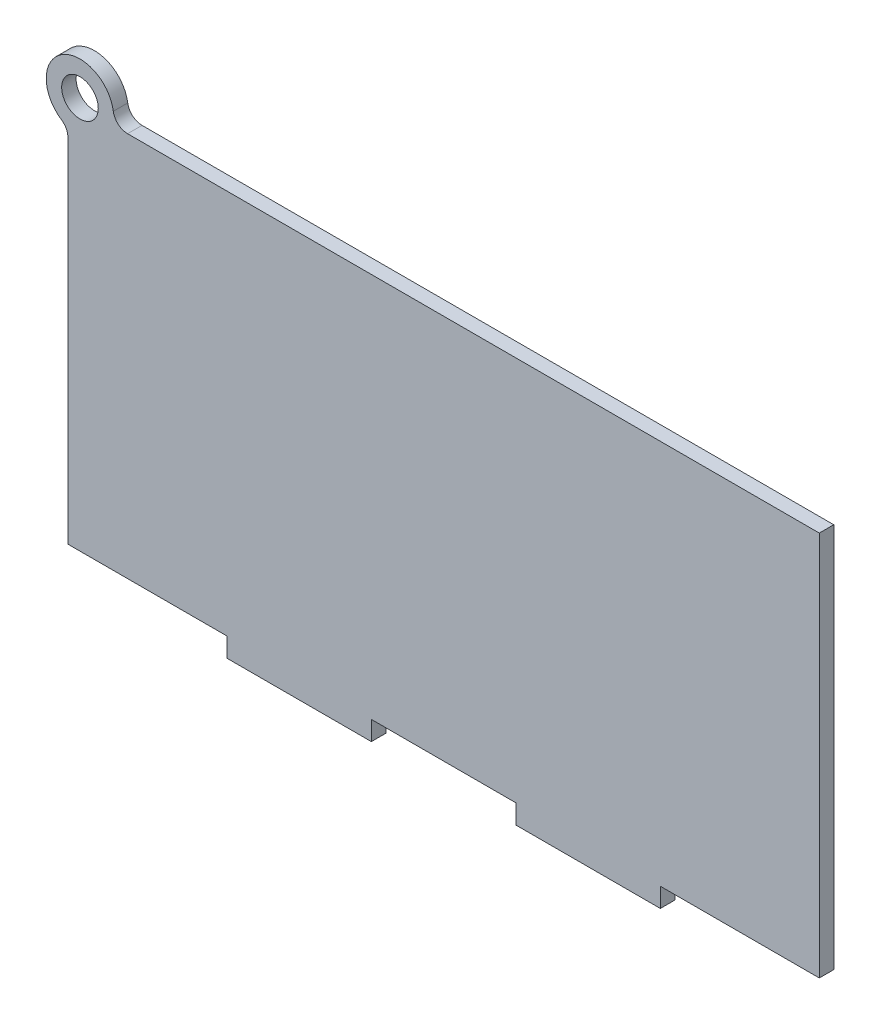
ISO-10303-21;
HEADER;
FILE_DESCRIPTION(('STEP AP214'),'2;1');
FILE_NAME('part.step','',(''),(''),'','','');
FILE_SCHEMA(('AUTOMOTIVE_DESIGN { 1 0 10303 214 1 1 1 1 }'));
ENDSEC;
DATA;
#1=APPLICATION_CONTEXT('core data for automotive mechanical design processes');
#2=APPLICATION_PROTOCOL_DEFINITION('international standard','automotive_design',2000,#1);
#3=PRODUCT_CONTEXT('',#1,'mechanical');
#4=PRODUCT('Part','Part','',(#3));
#5=PRODUCT_RELATED_PRODUCT_CATEGORY('part','',(#4));
#6=PRODUCT_DEFINITION_FORMATION('','',#4);
#7=PRODUCT_DEFINITION_CONTEXT('part definition',#1,'design');
#8=PRODUCT_DEFINITION('design','',#6,#7);
#9=PRODUCT_DEFINITION_SHAPE('','',#8);
#10=(LENGTH_UNIT() NAMED_UNIT(*) SI_UNIT(.MILLI.,.METRE.));
#11=(NAMED_UNIT(*) PLANE_ANGLE_UNIT() SI_UNIT($,.RADIAN.));
#12=(NAMED_UNIT(*) SI_UNIT($,.STERADIAN.) SOLID_ANGLE_UNIT());
#13=UNCERTAINTY_MEASURE_WITH_UNIT(LENGTH_MEASURE(1.E-05),#10,'distance_accuracy_value','');
#14=(GEOMETRIC_REPRESENTATION_CONTEXT(3) GLOBAL_UNCERTAINTY_ASSIGNED_CONTEXT((#13)) GLOBAL_UNIT_ASSIGNED_CONTEXT((#10,
#11,#12)) REPRESENTATION_CONTEXT('',''));
#15=CARTESIAN_POINT('',(0.,0.,0.));
#16=DIRECTION('',(0.,0.,1.));
#17=DIRECTION('',(1.,0.,0.));
#18=AXIS2_PLACEMENT_3D('',#15,#16,#17);
#19=CARTESIAN_POINT('',(-66.0593604878528,45.1837523820721,3.));
#20=DIRECTION('',(0.,0.,1.));
#21=DIRECTION('',(1.,0.,0.));
#22=AXIS2_PLACEMENT_3D('',#19,#20,#21);
#23=PLANE('',#22);
#24=DIRECTION('',(-1.,0.,0.));
#25=VECTOR('',#24,1.);
#26=CARTESIAN_POINT('',(77.5537795455046,42.1837523820721,3.));
#27=LINE('',#26,#25);
#28=CARTESIAN_POINT('',(77.5537795455046,42.1837523820721,3.));
#29=VERTEX_POINT('',#28);
#30=CARTESIAN_POINT('',(-66.0593604878528,42.1837523820721,3.));
#31=VERTEX_POINT('',#30);
#32=EDGE_CURVE('E201',#29,#31,#27,.T.);
#33=ORIENTED_EDGE('',*,*,#32,.T.);
#34=CARTESIAN_POINT('',(-66.0593604878528,45.1837523820721,3.));
#35=DIRECTION('',(0.,0.,-1.));
#36=DIRECTION('',(1.,0.,0.));
#37=AXIS2_PLACEMENT_3D('',#34,#35,#36);
#38=CIRCLE('',#37,3.);
#39=CARTESIAN_POINT('',(-69.0254184778456,44.7337523820721,3.));
#40=VERTEX_POINT('',#39);
#41=EDGE_CURVE('E113',#31,#40,#38,.T.);
#42=ORIENTED_EDGE('',*,*,#41,.T.);
#43=CARTESIAN_POINT('',(-75.9462204544954,43.6837523820721,3.));
#44=DIRECTION('',(0.,0.,1.));
#45=DIRECTION('',(1.,0.,0.));
#46=AXIS2_PLACEMENT_3D('',#43,#44,#45);
#47=CIRCLE('',#46,7.);
#48=CARTESIAN_POINT('',(-79.7962204544954,37.8375998011006,3.));
#49=VERTEX_POINT('',#48);
#50=EDGE_CURVE('E237',#40,#49,#47,.T.);
#51=ORIENTED_EDGE('',*,*,#50,.T.);
#52=CARTESIAN_POINT('',(-81.4462204544954,35.332105837827,3.));
#53=DIRECTION('',(0.,0.,-1.));
#54=DIRECTION('',(-1.,0.,0.));
#55=AXIS2_PLACEMENT_3D('',#52,#53,#54);
#56=CIRCLE('',#55,3.);
#57=CARTESIAN_POINT('',(-78.4462204544954,35.332105837827,3.));
#58=VERTEX_POINT('',#57);
#59=EDGE_CURVE('E255',#49,#58,#56,.T.);
#60=ORIENTED_EDGE('',*,*,#59,.T.);
#61=DIRECTION('',(0.,-1.,0.));
#62=VECTOR('',#61,1.);
#63=CARTESIAN_POINT('',(-78.4462204544954,-37.8162476179279,3.));
#64=LINE('',#63,#62);
#65=CARTESIAN_POINT('',(-78.4462204544954,-37.8162476179279,3.));
#66=VERTEX_POINT('',#65);
#67=EDGE_CURVE('E252',#58,#66,#64,.T.);
#68=ORIENTED_EDGE('',*,*,#67,.T.);
#69=DIRECTION('',(1.,0.,0.));
#70=VECTOR('',#69,1.);
#71=CARTESIAN_POINT('',(-78.4462204544954,-37.8162476179279,3.));
#72=LINE('',#71,#70);
#73=CARTESIAN_POINT('',(-45.4462204544954,-37.8162476179279,3.));
#74=VERTEX_POINT('',#73);
#75=EDGE_CURVE('E254',#66,#74,#72,.T.);
#76=ORIENTED_EDGE('',*,*,#75,.T.);
#77=DIRECTION('',(0.,-1.,0.));
#78=VECTOR('',#77,1.);
#79=CARTESIAN_POINT('',(-45.4462204544954,-41.8162476179279,3.));
#80=LINE('',#79,#78);
#81=CARTESIAN_POINT('',(-45.4462204544954,-41.8162476179279,3.));
#82=VERTEX_POINT('',#81);
#83=EDGE_CURVE('E257',#74,#82,#80,.T.);
#84=ORIENTED_EDGE('',*,*,#83,.T.);
#85=DIRECTION('',(1.,0.,0.));
#86=VECTOR('',#85,1.);
#87=CARTESIAN_POINT('',(-15.4462204544954,-41.8162476179279,3.));
#88=LINE('',#87,#86);
#89=CARTESIAN_POINT('',(-15.4462204544954,-41.8162476179279,3.));
#90=VERTEX_POINT('',#89);
#91=EDGE_CURVE('E263',#82,#90,#88,.T.);
#92=ORIENTED_EDGE('',*,*,#91,.T.);
#93=DIRECTION('',(0.,1.,0.));
#94=VECTOR('',#93,1.);
#95=CARTESIAN_POINT('',(-15.4462204544954,-41.8162476179279,3.));
#96=LINE('',#95,#94);
#97=CARTESIAN_POINT('',(-15.4462204544954,-37.8162476179279,3.));
#98=VERTEX_POINT('',#97);
#99=EDGE_CURVE('E265',#90,#98,#96,.T.);
#100=ORIENTED_EDGE('',*,*,#99,.T.);
#101=DIRECTION('',(1.,0.,0.));
#102=VECTOR('',#101,1.);
#103=CARTESIAN_POINT('',(-15.4462204544954,-37.8162476179279,3.));
#104=LINE('',#103,#102);
#105=CARTESIAN_POINT('',(14.5537795455046,-37.8162476179279,3.));
#106=VERTEX_POINT('',#105);
#107=EDGE_CURVE('E267',#98,#106,#104,.T.);
#108=ORIENTED_EDGE('',*,*,#107,.T.);
#109=DIRECTION('',(0.,-1.,0.));
#110=VECTOR('',#109,1.);
#111=CARTESIAN_POINT('',(14.5537795455046,-41.8162476179279,3.));
#112=LINE('',#111,#110);
#113=CARTESIAN_POINT('',(14.5537795455046,-41.8162476179279,3.));
#114=VERTEX_POINT('',#113);
#115=EDGE_CURVE('E269',#106,#114,#112,.T.);
#116=ORIENTED_EDGE('',*,*,#115,.T.);
#117=DIRECTION('',(1.,0.,0.));
#118=VECTOR('',#117,1.);
#119=CARTESIAN_POINT('',(44.5537795455046,-41.8162476179279,3.));
#120=LINE('',#119,#118);
#121=CARTESIAN_POINT('',(44.5537795455046,-41.8162476179279,3.));
#122=VERTEX_POINT('',#121);
#123=EDGE_CURVE('E153',#114,#122,#120,.T.);
#124=ORIENTED_EDGE('',*,*,#123,.T.);
#125=DIRECTION('',(0.,1.,0.));
#126=VECTOR('',#125,1.);
#127=CARTESIAN_POINT('',(44.5537795455046,-41.8162476179279,3.));
#128=LINE('',#127,#126);
#129=CARTESIAN_POINT('',(44.5537795455046,-37.8162476179279,3.));
#130=VERTEX_POINT('',#129);
#131=EDGE_CURVE('E147',#122,#130,#128,.T.);
#132=ORIENTED_EDGE('',*,*,#131,.T.);
#133=DIRECTION('',(1.,0.,0.));
#134=VECTOR('',#133,1.);
#135=CARTESIAN_POINT('',(44.5537795455046,-37.8162476179279,3.));
#136=LINE('',#135,#134);
#137=CARTESIAN_POINT('',(77.5537795455046,-37.8162476179279,3.));
#138=VERTEX_POINT('',#137);
#139=EDGE_CURVE('E151',#130,#138,#136,.T.);
#140=ORIENTED_EDGE('',*,*,#139,.T.);
#141=DIRECTION('',(0.,1.,0.));
#142=VECTOR('',#141,1.);
#143=CARTESIAN_POINT('',(77.5537795455046,-37.8162476179279,3.));
#144=LINE('',#143,#142);
#145=EDGE_CURVE('E49',#138,#29,#144,.T.);
#146=ORIENTED_EDGE('',*,*,#145,.T.);
#147=EDGE_LOOP('',(#33,#42,#51,#60,#68,#76,#84,#92,#100,#108,#116,#124,#132,#140,#146));
#148=FACE_BOUND('',#147,.T.);
#149=CARTESIAN_POINT('',(-75.9462204544954,43.6837523820721,3.));
#150=DIRECTION('',(0.,0.,1.));
#151=DIRECTION('',(1.,0.,0.));
#152=AXIS2_PLACEMENT_3D('',#149,#150,#151);
#153=CIRCLE('',#152,3.8);
#154=CARTESIAN_POINT('',(-72.1462204544954,43.6837523820721,3.));
#155=VERTEX_POINT('',#154);
#156=EDGE_CURVE('E175',#155,#155,#153,.T.);
#157=ORIENTED_EDGE('',*,*,#156,.F.);
#158=EDGE_LOOP('',(#157));
#159=FACE_BOUND('',#158,.T.);
#160=ADVANCED_FACE('F32',(#148,#159),#23,.T.);
#161=CARTESIAN_POINT('',(-66.0593604878528,45.1837523820721,0.));
#162=DIRECTION('',(0.,0.,1.));
#163=DIRECTION('',(1.,0.,0.));
#164=AXIS2_PLACEMENT_3D('',#161,#162,#163);
#165=PLANE('',#164);
#166=DIRECTION('',(-1.,0.,0.));
#167=VECTOR('',#166,1.);
#168=CARTESIAN_POINT('',(77.5537795455046,42.1837523820721,0.));
#169=LINE('',#168,#167);
#170=CARTESIAN_POINT('',(77.5537795455046,42.1837523820721,0.));
#171=VERTEX_POINT('',#170);
#172=CARTESIAN_POINT('',(-66.0593604878528,42.1837523820721,0.));
#173=VERTEX_POINT('',#172);
#174=EDGE_CURVE('E171',#171,#173,#169,.T.);
#175=ORIENTED_EDGE('',*,*,#174,.F.);
#176=DIRECTION('',(0.,1.,0.));
#177=VECTOR('',#176,1.);
#178=CARTESIAN_POINT('',(77.5537795455046,-37.8162476179279,0.));
#179=LINE('',#178,#177);
#180=CARTESIAN_POINT('',(77.5537795455046,-37.8162476179279,0.));
#181=VERTEX_POINT('',#180);
#182=EDGE_CURVE('E105',#181,#171,#179,.T.);
#183=ORIENTED_EDGE('',*,*,#182,.F.);
#184=DIRECTION('',(1.,0.,0.));
#185=VECTOR('',#184,1.);
#186=CARTESIAN_POINT('',(44.5537795455046,-37.8162476179279,0.));
#187=LINE('',#186,#185);
#188=CARTESIAN_POINT('',(44.5537795455046,-37.8162476179279,0.));
#189=VERTEX_POINT('',#188);
#190=EDGE_CURVE('E99',#189,#181,#187,.T.);
#191=ORIENTED_EDGE('',*,*,#190,.F.);
#192=DIRECTION('',(0.,1.,0.));
#193=VECTOR('',#192,1.);
#194=CARTESIAN_POINT('',(44.5537795455046,-41.8162476179279,0.));
#195=LINE('',#194,#193);
#196=CARTESIAN_POINT('',(44.5537795455046,-41.8162476179279,0.));
#197=VERTEX_POINT('',#196);
#198=EDGE_CURVE('E161',#197,#189,#195,.T.);
#199=ORIENTED_EDGE('',*,*,#198,.F.);
#200=DIRECTION('',(1.,0.,0.));
#201=VECTOR('',#200,1.);
#202=CARTESIAN_POINT('',(44.5537795455046,-41.8162476179279,0.));
#203=LINE('',#202,#201);
#204=CARTESIAN_POINT('',(14.5537795455046,-41.8162476179279,0.));
#205=VERTEX_POINT('',#204);
#206=EDGE_CURVE('E196',#205,#197,#203,.T.);
#207=ORIENTED_EDGE('',*,*,#206,.F.);
#208=DIRECTION('',(0.,-1.,0.));
#209=VECTOR('',#208,1.);
#210=CARTESIAN_POINT('',(14.5537795455046,-41.8162476179279,0.));
#211=LINE('',#210,#209);
#212=CARTESIAN_POINT('',(14.5537795455046,-37.8162476179279,0.));
#213=VERTEX_POINT('',#212);
#214=EDGE_CURVE('E194',#213,#205,#211,.T.);
#215=ORIENTED_EDGE('',*,*,#214,.F.);
#216=DIRECTION('',(1.,0.,0.));
#217=VECTOR('',#216,1.);
#218=CARTESIAN_POINT('',(-15.4462204544954,-37.8162476179279,0.));
#219=LINE('',#218,#217);
#220=CARTESIAN_POINT('',(-15.4462204544954,-37.8162476179279,0.));
#221=VERTEX_POINT('',#220);
#222=EDGE_CURVE('E192',#221,#213,#219,.T.);
#223=ORIENTED_EDGE('',*,*,#222,.F.);
#224=DIRECTION('',(0.,1.,0.));
#225=VECTOR('',#224,1.);
#226=CARTESIAN_POINT('',(-15.4462204544954,-41.8162476179279,0.));
#227=LINE('',#226,#225);
#228=CARTESIAN_POINT('',(-15.4462204544954,-41.8162476179279,0.));
#229=VERTEX_POINT('',#228);
#230=EDGE_CURVE('E190',#229,#221,#227,.T.);
#231=ORIENTED_EDGE('',*,*,#230,.F.);
#232=DIRECTION('',(1.,0.,0.));
#233=VECTOR('',#232,1.);
#234=CARTESIAN_POINT('',(-15.4462204544954,-41.8162476179279,0.));
#235=LINE('',#234,#233);
#236=CARTESIAN_POINT('',(-45.4462204544954,-41.8162476179279,0.));
#237=VERTEX_POINT('',#236);
#238=EDGE_CURVE('E188',#237,#229,#235,.T.);
#239=ORIENTED_EDGE('',*,*,#238,.F.);
#240=DIRECTION('',(0.,-1.,0.));
#241=VECTOR('',#240,1.);
#242=CARTESIAN_POINT('',(-45.4462204544954,-41.8162476179279,0.));
#243=LINE('',#242,#241);
#244=CARTESIAN_POINT('',(-45.4462204544954,-37.8162476179279,0.));
#245=VERTEX_POINT('',#244);
#246=EDGE_CURVE('E186',#245,#237,#243,.T.);
#247=ORIENTED_EDGE('',*,*,#246,.F.);
#248=DIRECTION('',(1.,0.,0.));
#249=VECTOR('',#248,1.);
#250=CARTESIAN_POINT('',(-75.4462204544954,-37.8162476179279,0.));
#251=LINE('',#250,#249);
#252=CARTESIAN_POINT('',(-78.4462204544954,-37.8162476179279,0.));
#253=VERTEX_POINT('',#252);
#254=EDGE_CURVE('E184',#253,#245,#251,.T.);
#255=ORIENTED_EDGE('',*,*,#254,.F.);
#256=DIRECTION('',(0.,-1.,0.));
#257=VECTOR('',#256,1.);
#258=CARTESIAN_POINT('',(-78.4462204544954,-37.8162476179279,0.));
#259=LINE('',#258,#257);
#260=CARTESIAN_POINT('',(-78.4462204544954,35.332105837827,0.));
#261=VERTEX_POINT('',#260);
#262=EDGE_CURVE('E181',#261,#253,#259,.T.);
#263=ORIENTED_EDGE('',*,*,#262,.F.);
#264=CARTESIAN_POINT('',(-81.4462204544954,35.332105837827,0.));
#265=DIRECTION('',(0.,0.,-1.));
#266=DIRECTION('',(-1.,0.,0.));
#267=AXIS2_PLACEMENT_3D('',#264,#265,#266);
#268=CIRCLE('',#267,3.);
#269=CARTESIAN_POINT('',(-79.7962204544954,37.8375998011006,0.));
#270=VERTEX_POINT('',#269);
#271=EDGE_CURVE('E179',#270,#261,#268,.T.);
#272=ORIENTED_EDGE('',*,*,#271,.F.);
#273=CARTESIAN_POINT('',(-75.9462204544954,43.6837523820721,0.));
#274=DIRECTION('',(0.,0.,1.));
#275=DIRECTION('',(1.,0.,0.));
#276=AXIS2_PLACEMENT_3D('',#273,#274,#275);
#277=CIRCLE('',#276,7.);
#278=CARTESIAN_POINT('',(-69.0254184778456,44.7337523820721,0.));
#279=VERTEX_POINT('',#278);
#280=EDGE_CURVE('E177',#279,#270,#277,.T.);
#281=ORIENTED_EDGE('',*,*,#280,.F.);
#282=CARTESIAN_POINT('',(-66.0593604878528,45.1837523820721,0.));
#283=DIRECTION('',(0.,0.,-1.));
#284=DIRECTION('',(1.,0.,0.));
#285=AXIS2_PLACEMENT_3D('',#282,#283,#284);
#286=CIRCLE('',#285,3.);
#287=EDGE_CURVE('E174',#173,#279,#286,.T.);
#288=ORIENTED_EDGE('',*,*,#287,.F.);
#289=EDGE_LOOP('',(#175,#183,#191,#199,#207,#215,#223,#231,#239,#247,#255,#263,#272,#281,#288));
#290=FACE_BOUND('',#289,.T.);
#291=CARTESIAN_POINT('',(-75.9462204544954,43.6837523820721,0.));
#292=DIRECTION('',(0.,0.,1.));
#293=DIRECTION('',(1.,0.,0.));
#294=AXIS2_PLACEMENT_3D('',#291,#292,#293);
#295=CIRCLE('',#294,3.8);
#296=CARTESIAN_POINT('',(-72.1462204544954,43.6837523820721,0.));
#297=VERTEX_POINT('',#296);
#298=EDGE_CURVE('E458',#297,#297,#295,.T.);
#299=ORIENTED_EDGE('',*,*,#298,.T.);
#300=EDGE_LOOP('',(#299));
#301=FACE_BOUND('',#300,.T.);
#302=ADVANCED_FACE('F241',(#290,#301),#165,.F.);
#303=CARTESIAN_POINT('',(77.5537795455046,42.1837523820721,3.));
#304=DIRECTION('',(0.,-1.,0.));
#305=DIRECTION('',(0.,0.,-1.));
#306=AXIS2_PLACEMENT_3D('',#303,#304,#305);
#307=PLANE('',#306);
#308=ORIENTED_EDGE('',*,*,#174,.T.);
#309=DIRECTION('',(0.,0.,-1.));
#310=VECTOR('',#309,1.);
#311=CARTESIAN_POINT('',(-66.0593604878528,42.1837523820721,3.));
#312=LINE('',#311,#310);
#313=EDGE_CURVE('E11',#31,#173,#312,.T.);
#314=ORIENTED_EDGE('',*,*,#313,.F.);
#315=ORIENTED_EDGE('',*,*,#32,.F.);
#316=DIRECTION('',(0.,0.,-1.));
#317=VECTOR('',#316,1.);
#318=CARTESIAN_POINT('',(77.5537795455046,42.1837523820721,3.));
#319=LINE('',#318,#317);
#320=EDGE_CURVE('E167',#29,#171,#319,.T.);
#321=ORIENTED_EDGE('',*,*,#320,.T.);
#322=EDGE_LOOP('',(#308,#314,#315,#321));
#323=FACE_BOUND('',#322,.T.);
#324=ADVANCED_FACE('F34',(#323),#307,.F.);
#325=CARTESIAN_POINT('',(-66.0593604878528,45.1837523820721,3.));
#326=DIRECTION('',(0.,0.,-1.));
#327=DIRECTION('',(-1.,0.,0.));
#328=AXIS2_PLACEMENT_3D('',#325,#326,#327);
#329=CYLINDRICAL_SURFACE('',#328,3.);
#330=ORIENTED_EDGE('',*,*,#287,.T.);
#331=DIRECTION('',(0.,0.,-1.));
#332=VECTOR('',#331,1.);
#333=CARTESIAN_POINT('',(-69.0254184778456,44.7337523820721,3.));
#334=LINE('',#333,#332);
#335=EDGE_CURVE('E41',#40,#279,#334,.T.);
#336=ORIENTED_EDGE('',*,*,#335,.F.);
#337=ORIENTED_EDGE('',*,*,#41,.F.);
#338=ORIENTED_EDGE('',*,*,#313,.T.);
#339=EDGE_LOOP('',(#330,#336,#337,#338));
#340=FACE_BOUND('',#339,.T.);
#341=ADVANCED_FACE('F303',(#340),#329,.F.);
#342=CARTESIAN_POINT('',(-75.9462204544954,43.6837523820721,3.));
#343=DIRECTION('',(0.,0.,-1.));
#344=DIRECTION('',(-1.,0.,0.));
#345=AXIS2_PLACEMENT_3D('',#342,#343,#344);
#346=CYLINDRICAL_SURFACE('',#345,7.);
#347=ORIENTED_EDGE('',*,*,#280,.T.);
#348=DIRECTION('',(0.,0.,-1.));
#349=VECTOR('',#348,1.);
#350=CARTESIAN_POINT('',(-79.7962204544954,37.8375998011006,3.));
#351=LINE('',#350,#349);
#352=EDGE_CURVE('E229',#49,#270,#351,.T.);
#353=ORIENTED_EDGE('',*,*,#352,.F.);
#354=ORIENTED_EDGE('',*,*,#50,.F.);
#355=ORIENTED_EDGE('',*,*,#335,.T.);
#356=EDGE_LOOP('',(#347,#353,#354,#355));
#357=FACE_BOUND('',#356,.T.);
#358=ADVANCED_FACE('F235',(#357),#346,.T.);
#359=CARTESIAN_POINT('',(-81.4462204544954,35.332105837827,3.));
#360=DIRECTION('',(0.,0.,-1.));
#361=DIRECTION('',(-1.,0.,0.));
#362=AXIS2_PLACEMENT_3D('',#359,#360,#361);
#363=CYLINDRICAL_SURFACE('',#362,3.);
#364=ORIENTED_EDGE('',*,*,#271,.T.);
#365=DIRECTION('',(0.,0.,-1.));
#366=VECTOR('',#365,1.);
#367=CARTESIAN_POINT('',(-78.4462204544954,35.332105837827,3.));
#368=LINE('',#367,#366);
#369=EDGE_CURVE('E226',#58,#261,#368,.T.);
#370=ORIENTED_EDGE('',*,*,#369,.F.);
#371=ORIENTED_EDGE('',*,*,#59,.F.);
#372=ORIENTED_EDGE('',*,*,#352,.T.);
#373=EDGE_LOOP('',(#364,#370,#371,#372));
#374=FACE_BOUND('',#373,.T.);
#375=ADVANCED_FACE('F246',(#374),#363,.F.);
#376=CARTESIAN_POINT('',(-78.4462204544954,-37.8162476179279,3.));
#377=DIRECTION('',(1.,0.,0.));
#378=DIRECTION('',(0.,0.,-1.));
#379=AXIS2_PLACEMENT_3D('',#376,#377,#378);
#380=PLANE('',#379);
#381=ORIENTED_EDGE('',*,*,#262,.T.);
#382=DIRECTION('',(0.,0.,-1.));
#383=VECTOR('',#382,1.);
#384=CARTESIAN_POINT('',(-78.4462204544954,-37.8162476179279,3.));
#385=LINE('',#384,#383);
#386=EDGE_CURVE('E223',#66,#253,#385,.T.);
#387=ORIENTED_EDGE('',*,*,#386,.F.);
#388=ORIENTED_EDGE('',*,*,#67,.F.);
#389=ORIENTED_EDGE('',*,*,#369,.T.);
#390=EDGE_LOOP('',(#381,#387,#388,#389));
#391=FACE_BOUND('',#390,.T.);
#392=ADVANCED_FACE('F250',(#391),#380,.F.);
#393=CARTESIAN_POINT('',(-75.4462204544954,-37.8162476179279,3.));
#394=DIRECTION('',(0.,1.,0.));
#395=DIRECTION('',(0.,0.,1.));
#396=AXIS2_PLACEMENT_3D('',#393,#394,#395);
#397=PLANE('',#396);
#398=ORIENTED_EDGE('',*,*,#254,.T.);
#399=DIRECTION('',(0.,0.,-1.));
#400=VECTOR('',#399,1.);
#401=CARTESIAN_POINT('',(-45.4462204544954,-37.8162476179279,3.));
#402=LINE('',#401,#400);
#403=EDGE_CURVE('E220',#74,#245,#402,.T.);
#404=ORIENTED_EDGE('',*,*,#403,.F.);
#405=ORIENTED_EDGE('',*,*,#75,.F.);
#406=ORIENTED_EDGE('',*,*,#386,.T.);
#407=EDGE_LOOP('',(#398,#404,#405,#406));
#408=FACE_BOUND('',#407,.T.);
#409=ADVANCED_FACE('F316',(#408),#397,.F.);
#410=CARTESIAN_POINT('',(-45.4462204544954,-41.8162476179279,3.));
#411=DIRECTION('',(1.,0.,0.));
#412=DIRECTION('',(0.,0.,-1.));
#413=AXIS2_PLACEMENT_3D('',#410,#411,#412);
#414=PLANE('',#413);
#415=ORIENTED_EDGE('',*,*,#246,.T.);
#416=DIRECTION('',(0.,0.,-1.));
#417=VECTOR('',#416,1.);
#418=CARTESIAN_POINT('',(-45.4462204544954,-41.8162476179279,3.));
#419=LINE('',#418,#417);
#420=EDGE_CURVE('E217',#82,#237,#419,.T.);
#421=ORIENTED_EDGE('',*,*,#420,.F.);
#422=ORIENTED_EDGE('',*,*,#83,.F.);
#423=ORIENTED_EDGE('',*,*,#403,.T.);
#424=EDGE_LOOP('',(#415,#421,#422,#423));
#425=FACE_BOUND('',#424,.T.);
#426=ADVANCED_FACE('F319',(#425),#414,.F.);
#427=CARTESIAN_POINT('',(-15.4462204544954,-41.8162476179279,3.));
#428=DIRECTION('',(0.,1.,0.));
#429=DIRECTION('',(0.,0.,1.));
#430=AXIS2_PLACEMENT_3D('',#427,#428,#429);
#431=PLANE('',#430);
#432=ORIENTED_EDGE('',*,*,#238,.T.);
#433=DIRECTION('',(0.,0.,-1.));
#434=VECTOR('',#433,1.);
#435=CARTESIAN_POINT('',(-15.4462204544954,-41.8162476179279,3.));
#436=LINE('',#435,#434);
#437=EDGE_CURVE('E214',#90,#229,#436,.T.);
#438=ORIENTED_EDGE('',*,*,#437,.F.);
#439=ORIENTED_EDGE('',*,*,#91,.F.);
#440=ORIENTED_EDGE('',*,*,#420,.T.);
#441=EDGE_LOOP('',(#432,#438,#439,#440));
#442=FACE_BOUND('',#441,.T.);
#443=ADVANCED_FACE('F323',(#442),#431,.F.);
#444=CARTESIAN_POINT('',(-15.4462204544954,-41.8162476179279,3.));
#445=DIRECTION('',(-1.,0.,0.));
#446=DIRECTION('',(0.,0.,1.));
#447=AXIS2_PLACEMENT_3D('',#444,#445,#446);
#448=PLANE('',#447);
#449=ORIENTED_EDGE('',*,*,#230,.T.);
#450=DIRECTION('',(0.,0.,-1.));
#451=VECTOR('',#450,1.);
#452=CARTESIAN_POINT('',(-15.4462204544954,-37.8162476179279,3.));
#453=LINE('',#452,#451);
#454=EDGE_CURVE('E211',#98,#221,#453,.T.);
#455=ORIENTED_EDGE('',*,*,#454,.F.);
#456=ORIENTED_EDGE('',*,*,#99,.F.);
#457=ORIENTED_EDGE('',*,*,#437,.T.);
#458=EDGE_LOOP('',(#449,#455,#456,#457));
#459=FACE_BOUND('',#458,.T.);
#460=ADVANCED_FACE('F327',(#459),#448,.F.);
#461=CARTESIAN_POINT('',(-15.4462204544954,-37.8162476179279,3.));
#462=DIRECTION('',(0.,1.,0.));
#463=DIRECTION('',(0.,0.,1.));
#464=AXIS2_PLACEMENT_3D('',#461,#462,#463);
#465=PLANE('',#464);
#466=ORIENTED_EDGE('',*,*,#222,.T.);
#467=DIRECTION('',(0.,0.,-1.));
#468=VECTOR('',#467,1.);
#469=CARTESIAN_POINT('',(14.5537795455046,-37.8162476179279,3.));
#470=LINE('',#469,#468);
#471=EDGE_CURVE('E208',#106,#213,#470,.T.);
#472=ORIENTED_EDGE('',*,*,#471,.F.);
#473=ORIENTED_EDGE('',*,*,#107,.F.);
#474=ORIENTED_EDGE('',*,*,#454,.T.);
#475=EDGE_LOOP('',(#466,#472,#473,#474));
#476=FACE_BOUND('',#475,.T.);
#477=ADVANCED_FACE('F331',(#476),#465,.F.);
#478=CARTESIAN_POINT('',(14.5537795455046,-41.8162476179279,3.));
#479=DIRECTION('',(1.,0.,0.));
#480=DIRECTION('',(0.,0.,-1.));
#481=AXIS2_PLACEMENT_3D('',#478,#479,#480);
#482=PLANE('',#481);
#483=ORIENTED_EDGE('',*,*,#214,.T.);
#484=DIRECTION('',(0.,0.,-1.));
#485=VECTOR('',#484,1.);
#486=CARTESIAN_POINT('',(14.5537795455046,-41.8162476179279,3.));
#487=LINE('',#486,#485);
#488=EDGE_CURVE('E205',#114,#205,#487,.T.);
#489=ORIENTED_EDGE('',*,*,#488,.F.);
#490=ORIENTED_EDGE('',*,*,#115,.F.);
#491=ORIENTED_EDGE('',*,*,#471,.T.);
#492=EDGE_LOOP('',(#483,#489,#490,#491));
#493=FACE_BOUND('',#492,.T.);
#494=ADVANCED_FACE('F275',(#493),#482,.F.);
#495=CARTESIAN_POINT('',(44.5537795455046,-41.8162476179279,3.));
#496=DIRECTION('',(0.,1.,0.));
#497=DIRECTION('',(0.,0.,1.));
#498=AXIS2_PLACEMENT_3D('',#495,#496,#497);
#499=PLANE('',#498);
#500=ORIENTED_EDGE('',*,*,#206,.T.);
#501=DIRECTION('',(0.,0.,-1.));
#502=VECTOR('',#501,1.);
#503=CARTESIAN_POINT('',(44.5537795455046,-41.8162476179279,3.));
#504=LINE('',#503,#502);
#505=EDGE_CURVE('E162',#122,#197,#504,.T.);
#506=ORIENTED_EDGE('',*,*,#505,.F.);
#507=ORIENTED_EDGE('',*,*,#123,.F.);
#508=ORIENTED_EDGE('',*,*,#488,.T.);
#509=EDGE_LOOP('',(#500,#506,#507,#508));
#510=FACE_BOUND('',#509,.T.);
#511=ADVANCED_FACE('F279',(#510),#499,.F.);
#512=CARTESIAN_POINT('',(44.5537795455046,-41.8162476179279,3.));
#513=DIRECTION('',(-1.,0.,0.));
#514=DIRECTION('',(0.,0.,1.));
#515=AXIS2_PLACEMENT_3D('',#512,#513,#514);
#516=PLANE('',#515);
#517=ORIENTED_EDGE('',*,*,#198,.T.);
#518=DIRECTION('',(0.,0.,-1.));
#519=VECTOR('',#518,1.);
#520=CARTESIAN_POINT('',(44.5537795455046,-37.8162476179279,3.));
#521=LINE('',#520,#519);
#522=EDGE_CURVE('E158',#130,#189,#521,.T.);
#523=ORIENTED_EDGE('',*,*,#522,.F.);
#524=ORIENTED_EDGE('',*,*,#131,.F.);
#525=ORIENTED_EDGE('',*,*,#505,.T.);
#526=EDGE_LOOP('',(#517,#523,#524,#525));
#527=FACE_BOUND('',#526,.T.);
#528=ADVANCED_FACE('F159',(#527),#516,.F.);
#529=CARTESIAN_POINT('',(44.5537795455046,-37.8162476179279,3.));
#530=DIRECTION('',(0.,1.,0.));
#531=DIRECTION('',(0.,0.,1.));
#532=AXIS2_PLACEMENT_3D('',#529,#530,#531);
#533=PLANE('',#532);
#534=ORIENTED_EDGE('',*,*,#190,.T.);
#535=DIRECTION('',(0.,0.,-1.));
#536=VECTOR('',#535,1.);
#537=CARTESIAN_POINT('',(77.5537795455046,-37.8162476179279,3.));
#538=LINE('',#537,#536);
#539=EDGE_CURVE('E163',#138,#181,#538,.T.);
#540=ORIENTED_EDGE('',*,*,#539,.F.);
#541=ORIENTED_EDGE('',*,*,#139,.F.);
#542=ORIENTED_EDGE('',*,*,#522,.T.);
#543=EDGE_LOOP('',(#534,#540,#541,#542));
#544=FACE_BOUND('',#543,.T.);
#545=ADVANCED_FACE('F165',(#544),#533,.F.);
#546=CARTESIAN_POINT('',(77.5537795455046,-37.8162476179279,3.));
#547=DIRECTION('',(-1.,0.,0.));
#548=DIRECTION('',(0.,0.,1.));
#549=AXIS2_PLACEMENT_3D('',#546,#547,#548);
#550=PLANE('',#549);
#551=ORIENTED_EDGE('',*,*,#182,.T.);
#552=ORIENTED_EDGE('',*,*,#320,.F.);
#553=ORIENTED_EDGE('',*,*,#145,.F.);
#554=ORIENTED_EDGE('',*,*,#539,.T.);
#555=EDGE_LOOP('',(#551,#552,#553,#554));
#556=FACE_BOUND('',#555,.T.);
#557=ADVANCED_FACE('F283',(#556),#550,.F.);
#558=CARTESIAN_POINT('',(-75.9462204544954,43.6837523820721,3.));
#559=DIRECTION('',(0.,0.,-1.));
#560=DIRECTION('',(-1.,0.,0.));
#561=AXIS2_PLACEMENT_3D('',#558,#559,#560);
#562=CYLINDRICAL_SURFACE('',#561,3.8);
#563=ORIENTED_EDGE('',*,*,#156,.T.);
#564=EDGE_LOOP('',(#563));
#565=FACE_BOUND('',#564,.T.);
#566=ORIENTED_EDGE('',*,*,#298,.F.);
#567=EDGE_LOOP('',(#566));
#568=FACE_BOUND('',#567,.T.);
#569=ADVANCED_FACE('F285',(#565,#568),#562,.F.);
#570=CLOSED_SHELL('',(#160,#302,#324,#341,#358,#375,#392,#409,#426,#443,#460,#477,#494,#511,
#528,#545,#557,#569));
#571=MANIFOLD_SOLID_BREP('B2',#570);
#572=ADVANCED_BREP_SHAPE_REPRESENTATION('',(#18,#571),#14);
#573=SHAPE_DEFINITION_REPRESENTATION(#9,#572);
ENDSEC;
END-ISO-10303-21;
